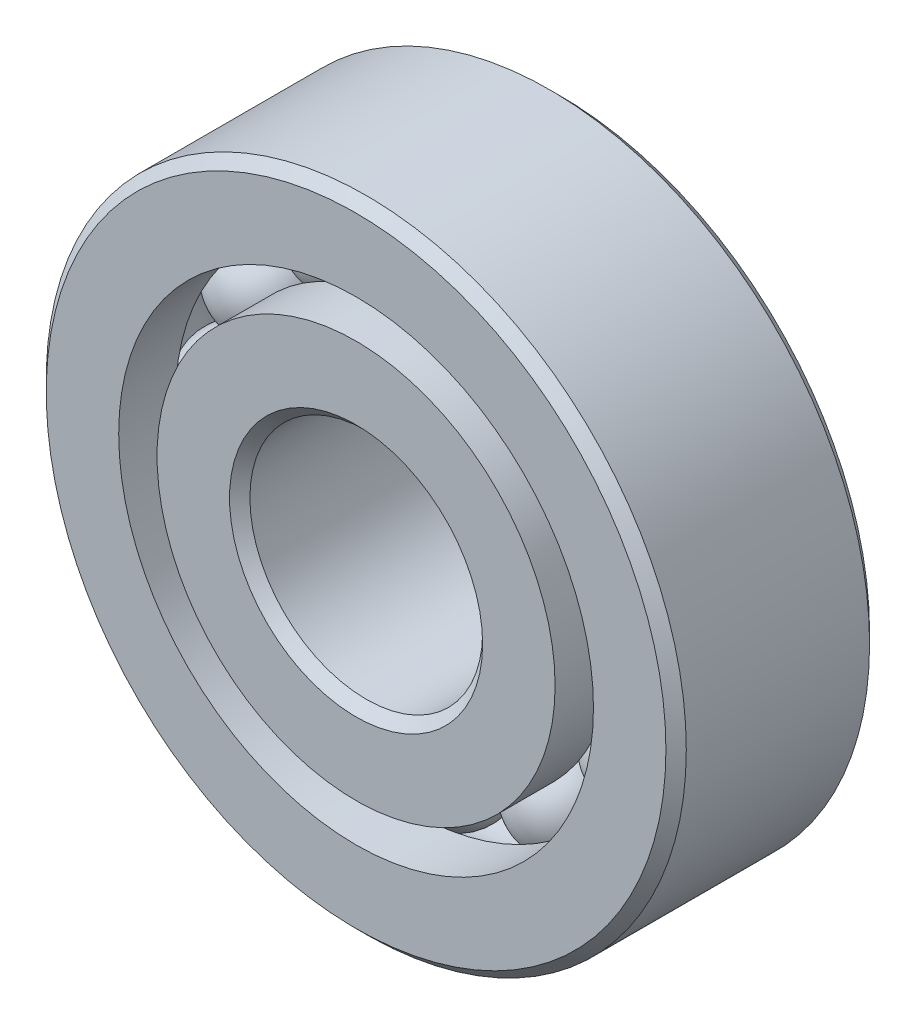
ISO-10303-21;
HEADER;
FILE_DESCRIPTION(('STEP AP214'),'2;1');
FILE_NAME('part.step','',(''),(''),'','','');
FILE_SCHEMA(('AUTOMOTIVE_DESIGN { 1 0 10303 214 1 1 1 1 }'));
ENDSEC;
DATA;
#1=APPLICATION_CONTEXT('core data for automotive mechanical design processes');
#2=APPLICATION_PROTOCOL_DEFINITION('international standard','automotive_design',2000,#1);
#3=PRODUCT_CONTEXT('',#1,'mechanical');
#4=PRODUCT('Part','Part','',(#3));
#5=PRODUCT_RELATED_PRODUCT_CATEGORY('part','',(#4));
#6=PRODUCT_DEFINITION_FORMATION('','',#4);
#7=PRODUCT_DEFINITION_CONTEXT('part definition',#1,'design');
#8=PRODUCT_DEFINITION('design','',#6,#7);
#9=PRODUCT_DEFINITION_SHAPE('','',#8);
#10=(LENGTH_UNIT() NAMED_UNIT(*) SI_UNIT(.MILLI.,.METRE.));
#11=(NAMED_UNIT(*) PLANE_ANGLE_UNIT() SI_UNIT($,.RADIAN.));
#12=(NAMED_UNIT(*) SI_UNIT($,.STERADIAN.) SOLID_ANGLE_UNIT());
#13=UNCERTAINTY_MEASURE_WITH_UNIT(LENGTH_MEASURE(1.E-05),#10,'distance_accuracy_value','');
#14=(GEOMETRIC_REPRESENTATION_CONTEXT(3) GLOBAL_UNCERTAINTY_ASSIGNED_CONTEXT((#13)) GLOBAL_UNIT_ASSIGNED_CONTEXT((#10,
#11,#12)) REPRESENTATION_CONTEXT('',''));
#15=CARTESIAN_POINT('',(0.,0.,0.));
#16=DIRECTION('',(0.,0.,1.));
#17=DIRECTION('',(1.,0.,0.));
#18=AXIS2_PLACEMENT_3D('',#15,#16,#17);
#19=CARTESIAN_POINT('',(-3.74999999999992,6.49519052838334,0.));
#20=DIRECTION('',(0.,0.,1.));
#21=DIRECTION('',(-0.499999999999989,0.866025403784445,0.));
#22=AXIS2_PLACEMENT_3D('',#19,#20,#21);
#23=SPHERICAL_SURFACE('',#22,1.68952158656808);
#24=CARTESIAN_POINT('',(-3.74999999999992,6.49519052838334,1.68952158656808));
#25=VERTEX_POINT('',#24);
#26=VERTEX_LOOP('',#25);
#27=FACE_BOUND('',#26,.T.);
#28=ADVANCED_FACE('F43',(#27),#23,.T.);
#29=CLOSED_SHELL('',(#28));
#30=MANIFOLD_SOLID_BREP('B2_NOT_SHOWN',#29);
#31=CARTESIAN_POINT('',(-6.49519052838325,3.75000000000008,0.));
#32=DIRECTION('',(0.,0.,1.));
#33=DIRECTION('',(-0.866025403784433,0.50000000000001,0.));
#34=AXIS2_PLACEMENT_3D('',#31,#32,#33);
#35=SPHERICAL_SURFACE('',#34,1.68952158656808);
#36=CARTESIAN_POINT('',(-6.49519052838325,3.75000000000008,1.68952158656808));
#37=VERTEX_POINT('',#36);
#38=VERTEX_LOOP('',#37);
#39=FACE_BOUND('',#38,.T.);
#40=ADVANCED_FACE('F64',(#39),#35,.T.);
#41=CLOSED_SHELL('',(#40));
#42=MANIFOLD_SOLID_BREP('B6_NOT_SHOWN',#41);
#43=CARTESIAN_POINT('',(-7.5,0.,0.));
#44=DIRECTION('',(0.,0.,1.));
#45=DIRECTION('',(-1.,0.,0.));
#46=AXIS2_PLACEMENT_3D('',#43,#44,#45);
#47=SPHERICAL_SURFACE('',#46,1.68952158656808);
#48=CARTESIAN_POINT('',(-7.5,0.,1.68952158656808));
#49=VERTEX_POINT('',#48);
#50=VERTEX_LOOP('',#49);
#51=FACE_BOUND('',#50,.T.);
#52=ADVANCED_FACE('F85',(#51),#47,.T.);
#53=CLOSED_SHELL('',(#52));
#54=MANIFOLD_SOLID_BREP('B39_NOT_SHOWN',#53);
#55=CARTESIAN_POINT('',(-6.49519052838332,-3.74999999999994,0.));
#56=DIRECTION('',(0.,0.,1.));
#57=DIRECTION('',(-0.866025403784443,-0.499999999999992,0.));
#58=AXIS2_PLACEMENT_3D('',#55,#56,#57);
#59=SPHERICAL_SURFACE('',#58,1.68952158656808);
#60=CARTESIAN_POINT('',(-6.49519052838332,-3.74999999999994,1.68952158656808));
#61=VERTEX_POINT('',#60);
#62=VERTEX_LOOP('',#61);
#63=FACE_BOUND('',#62,.T.);
#64=ADVANCED_FACE('F106',(#63),#59,.T.);
#65=CLOSED_SHELL('',(#64));
#66=MANIFOLD_SOLID_BREP('B60_NOT_SHOWN',#65);
#67=CARTESIAN_POINT('',(-3.75000000000005,-6.49519052838326,0.));
#68=DIRECTION('',(0.,0.,1.));
#69=DIRECTION('',(-0.500000000000007,-0.866025403784435,0.));
#70=AXIS2_PLACEMENT_3D('',#67,#68,#69);
#71=SPHERICAL_SURFACE('',#70,1.68952158656808);
#72=CARTESIAN_POINT('',(-3.75000000000005,-6.49519052838326,1.68952158656808));
#73=VERTEX_POINT('',#72);
#74=VERTEX_LOOP('',#73);
#75=FACE_BOUND('',#74,.T.);
#76=ADVANCED_FACE('F127',(#75),#71,.T.);
#77=CLOSED_SHELL('',(#76));
#78=MANIFOLD_SOLID_BREP('B81_NOT_SHOWN',#77);
#79=CARTESIAN_POINT('',(0.,-7.5,0.));
#80=DIRECTION('',(0.,0.,1.));
#81=DIRECTION('',(0.,-1.,0.));
#82=AXIS2_PLACEMENT_3D('',#79,#80,#81);
#83=SPHERICAL_SURFACE('',#82,1.68952158656808);
#84=CARTESIAN_POINT('',(0.,-7.5,1.68952158656808));
#85=VERTEX_POINT('',#84);
#86=VERTEX_LOOP('',#85);
#87=FACE_BOUND('',#86,.T.);
#88=ADVANCED_FACE('F148',(#87),#83,.T.);
#89=CLOSED_SHELL('',(#88));
#90=MANIFOLD_SOLID_BREP('B102_NOT_SHOWN',#89);
#91=CARTESIAN_POINT('',(3.74999999999996,-6.49519052838331,0.));
#92=DIRECTION('',(0.,0.,1.));
#93=DIRECTION('',(0.499999999999995,-0.866025403784442,0.));
#94=AXIS2_PLACEMENT_3D('',#91,#92,#93);
#95=SPHERICAL_SURFACE('',#94,1.68952158656808);
#96=CARTESIAN_POINT('',(3.74999999999996,-6.49519052838331,1.68952158656808));
#97=VERTEX_POINT('',#96);
#98=VERTEX_LOOP('',#97);
#99=FACE_BOUND('',#98,.T.);
#100=ADVANCED_FACE('F169',(#99),#95,.T.);
#101=CLOSED_SHELL('',(#100));
#102=MANIFOLD_SOLID_BREP('B123_NOT_SHOWN',#101);
#103=CARTESIAN_POINT('',(6.49519052838327,-3.75000000000003,0.));
#104=DIRECTION('',(0.,0.,1.));
#105=DIRECTION('',(0.866025403784436,-0.500000000000004,0.));
#106=AXIS2_PLACEMENT_3D('',#103,#104,#105);
#107=SPHERICAL_SURFACE('',#106,1.68952158656808);
#108=CARTESIAN_POINT('',(6.49519052838327,-3.75000000000003,1.68952158656808));
#109=VERTEX_POINT('',#108);
#110=VERTEX_LOOP('',#109);
#111=FACE_BOUND('',#110,.T.);
#112=ADVANCED_FACE('F190',(#111),#107,.T.);
#113=CLOSED_SHELL('',(#112));
#114=MANIFOLD_SOLID_BREP('B144_NOT_SHOWN',#113);
#115=CARTESIAN_POINT('',(7.5,0.,0.));
#116=DIRECTION('',(0.,0.,1.));
#117=DIRECTION('',(1.,0.,0.));
#118=AXIS2_PLACEMENT_3D('',#115,#116,#117);
#119=SPHERICAL_SURFACE('',#118,1.68952158656808);
#120=CARTESIAN_POINT('',(7.5,0.,1.68952158656808));
#121=VERTEX_POINT('',#120);
#122=VERTEX_LOOP('',#121);
#123=FACE_BOUND('',#122,.T.);
#124=ADVANCED_FACE('F211',(#123),#119,.T.);
#125=CLOSED_SHELL('',(#124));
#126=MANIFOLD_SOLID_BREP('B165_NOT_SHOWN',#125);
#127=CARTESIAN_POINT('',(6.4951905283833,3.74999999999998,0.));
#128=DIRECTION('',(0.,0.,1.));
#129=DIRECTION('',(0.86602540378444,0.499999999999998,0.));
#130=AXIS2_PLACEMENT_3D('',#127,#128,#129);
#131=SPHERICAL_SURFACE('',#130,1.68952158656808);
#132=CARTESIAN_POINT('',(6.4951905283833,3.74999999999998,1.68952158656808));
#133=VERTEX_POINT('',#132);
#134=VERTEX_LOOP('',#133);
#135=FACE_BOUND('',#134,.T.);
#136=ADVANCED_FACE('F232',(#135),#131,.T.);
#137=CLOSED_SHELL('',(#136));
#138=MANIFOLD_SOLID_BREP('B186_NOT_SHOWN',#137);
#139=CARTESIAN_POINT('',(3.75000000000001,6.49519052838328,0.));
#140=DIRECTION('',(0.,0.,1.));
#141=DIRECTION('',(0.500000000000001,0.866025403784438,0.));
#142=AXIS2_PLACEMENT_3D('',#139,#140,#141);
#143=SPHERICAL_SURFACE('',#142,1.68952158656808);
#144=CARTESIAN_POINT('',(3.75000000000001,6.49519052838328,1.68952158656808));
#145=VERTEX_POINT('',#144);
#146=VERTEX_LOOP('',#145);
#147=FACE_BOUND('',#146,.T.);
#148=ADVANCED_FACE('F253',(#147),#143,.T.);
#149=CLOSED_SHELL('',(#148));
#150=MANIFOLD_SOLID_BREP('B207_NOT_SHOWN',#149);
#151=CARTESIAN_POINT('',(0.,7.5,0.));
#152=DIRECTION('',(0.,0.,1.));
#153=DIRECTION('',(0.,1.,0.));
#154=AXIS2_PLACEMENT_3D('',#151,#152,#153);
#155=SPHERICAL_SURFACE('',#154,1.68952158656808);
#156=CARTESIAN_POINT('',(0.,7.5,1.68952158656808));
#157=VERTEX_POINT('',#156);
#158=VERTEX_LOOP('',#157);
#159=FACE_BOUND('',#158,.T.);
#160=ADVANCED_FACE('F275',(#159),#155,.T.);
#161=CLOSED_SHELL('',(#160));
#162=MANIFOLD_SOLID_BREP('B228',#161);
#163=CARTESIAN_POINT('',(0.,6.84065934065934,3.5));
#164=DIRECTION('',(0.,0.,-1.));
#165=DIRECTION('',(-1.,0.,0.));
#166=AXIS2_PLACEMENT_3D('',#163,#164,#165);
#167=PLANE('',#166);
#168=CARTESIAN_POINT('',(0.,0.,3.5));
#169=DIRECTION('',(0.,0.,1.));
#170=DIRECTION('',(1.,0.,0.));
#171=AXIS2_PLACEMENT_3D('',#168,#169,#170);
#172=CIRCLE('',#171,4.35);
#173=CARTESIAN_POINT('',(4.35,0.,3.5));
#174=VERTEX_POINT('',#173);
#175=EDGE_CURVE('E323',#174,#174,#172,.T.);
#176=ORIENTED_EDGE('',*,*,#175,.F.);
#177=EDGE_LOOP('',(#176));
#178=FACE_BOUND('',#177,.T.);
#179=CARTESIAN_POINT('',(0.,0.,3.5));
#180=DIRECTION('',(0.,0.,1.));
#181=DIRECTION('',(1.,0.,0.));
#182=AXIS2_PLACEMENT_3D('',#179,#180,#181);
#183=CIRCLE('',#182,6.84065934065934);
#184=CARTESIAN_POINT('',(6.84065934065934,0.,3.5));
#185=VERTEX_POINT('',#184);
#186=EDGE_CURVE('E274',#185,#185,#183,.T.);
#187=ORIENTED_EDGE('',*,*,#186,.T.);
#188=EDGE_LOOP('',(#187));
#189=FACE_BOUND('',#188,.T.);
#190=ADVANCED_FACE('F295',(#178,#189),#167,.F.);
#191=CARTESIAN_POINT('',(0.,0.,3.5));
#192=DIRECTION('',(0.,0.,1.));
#193=DIRECTION('',(1.,0.,0.));
#194=AXIS2_PLACEMENT_3D('',#191,#192,#193);
#195=CYLINDRICAL_SURFACE('',#194,6.84065934065934);
#196=ORIENTED_EDGE('',*,*,#186,.F.);
#197=EDGE_LOOP('',(#196));
#198=FACE_BOUND('',#197,.T.);
#199=CARTESIAN_POINT('',(0.,0.,1.55555555555556));
#200=DIRECTION('',(0.,0.,1.));
#201=DIRECTION('',(1.,0.,0.));
#202=AXIS2_PLACEMENT_3D('',#199,#200,#201);
#203=CIRCLE('',#202,6.84065934065934);
#204=CARTESIAN_POINT('',(6.84065934065934,0.,1.55555555555556));
#205=VERTEX_POINT('',#204);
#206=EDGE_CURVE('E301',#205,#205,#203,.T.);
#207=ORIENTED_EDGE('',*,*,#206,.T.);
#208=EDGE_LOOP('',(#207));
#209=FACE_BOUND('',#208,.T.);
#210=ADVANCED_FACE('F330',(#198,#209),#195,.T.);
#211=CARTESIAN_POINT('',(0.,0.,0.));
#212=DIRECTION('',(0.,0.,1.));
#213=DIRECTION('',(1.,0.,0.));
#214=AXIS2_PLACEMENT_3D('',#211,#212,#213);
#215=TOROIDAL_SURFACE('',#214,7.5,1.68952158656808);
#216=ORIENTED_EDGE('',*,*,#206,.F.);
#217=EDGE_LOOP('',(#216));
#218=FACE_BOUND('',#217,.T.);
#219=CARTESIAN_POINT('',(0.,0.,-1.55555555555556));
#220=DIRECTION('',(0.,0.,1.));
#221=DIRECTION('',(1.,0.,0.));
#222=AXIS2_PLACEMENT_3D('',#219,#220,#221);
#223=CIRCLE('',#222,6.84065934065934);
#224=CARTESIAN_POINT('',(6.84065934065934,0.,-1.55555555555556));
#225=VERTEX_POINT('',#224);
#226=EDGE_CURVE('E305',#225,#225,#223,.T.);
#227=ORIENTED_EDGE('',*,*,#226,.T.);
#228=EDGE_LOOP('',(#227));
#229=FACE_BOUND('',#228,.T.);
#230=ADVANCED_FACE('F334',(#218,#229),#215,.F.);
#231=CARTESIAN_POINT('',(0.,0.,3.5));
#232=DIRECTION('',(0.,0.,1.));
#233=DIRECTION('',(1.,0.,0.));
#234=AXIS2_PLACEMENT_3D('',#231,#232,#233);
#235=CYLINDRICAL_SURFACE('',#234,6.84065934065934);
#236=ORIENTED_EDGE('',*,*,#226,.F.);
#237=EDGE_LOOP('',(#236));
#238=FACE_BOUND('',#237,.T.);
#239=CARTESIAN_POINT('',(0.,0.,-3.5));
#240=DIRECTION('',(0.,0.,1.));
#241=DIRECTION('',(1.,0.,0.));
#242=AXIS2_PLACEMENT_3D('',#239,#240,#241);
#243=CIRCLE('',#242,6.84065934065934);
#244=CARTESIAN_POINT('',(6.84065934065934,0.,-3.5));
#245=VERTEX_POINT('',#244);
#246=EDGE_CURVE('E309',#245,#245,#243,.T.);
#247=ORIENTED_EDGE('',*,*,#246,.T.);
#248=EDGE_LOOP('',(#247));
#249=FACE_BOUND('',#248,.T.);
#250=ADVANCED_FACE('F339',(#238,#249),#235,.T.);
#251=CARTESIAN_POINT('',(0.,4.35,-3.5));
#252=DIRECTION('',(0.,0.,1.));
#253=DIRECTION('',(1.,0.,0.));
#254=AXIS2_PLACEMENT_3D('',#251,#252,#253);
#255=PLANE('',#254);
#256=ORIENTED_EDGE('',*,*,#246,.F.);
#257=EDGE_LOOP('',(#256));
#258=FACE_BOUND('',#257,.T.);
#259=CARTESIAN_POINT('',(0.,0.,-3.5));
#260=DIRECTION('',(0.,0.,1.));
#261=DIRECTION('',(1.,0.,0.));
#262=AXIS2_PLACEMENT_3D('',#259,#260,#261);
#263=CIRCLE('',#262,4.35);
#264=CARTESIAN_POINT('',(4.35,0.,-3.5));
#265=VERTEX_POINT('',#264);
#266=EDGE_CURVE('E314',#265,#265,#263,.T.);
#267=ORIENTED_EDGE('',*,*,#266,.T.);
#268=EDGE_LOOP('',(#267));
#269=FACE_BOUND('',#268,.T.);
#270=ADVANCED_FACE('F345',(#258,#269),#255,.F.);
#271=CARTESIAN_POINT('',(0.,0.,-3.15));
#272=DIRECTION('',(0.,0.,-1.));
#273=DIRECTION('',(-1.,0.,0.));
#274=AXIS2_PLACEMENT_3D('',#271,#272,#273);
#275=CONICAL_SURFACE('',#274,4.,0.785398163397446);
#276=ORIENTED_EDGE('',*,*,#266,.F.);
#277=EDGE_LOOP('',(#276));
#278=FACE_BOUND('',#277,.T.);
#279=CARTESIAN_POINT('',(0.,0.,-3.15));
#280=DIRECTION('',(0.,0.,1.));
#281=DIRECTION('',(1.,0.,0.));
#282=AXIS2_PLACEMENT_3D('',#279,#280,#281);
#283=CIRCLE('',#282,4.);
#284=CARTESIAN_POINT('',(4.,0.,-3.15));
#285=VERTEX_POINT('',#284);
#286=EDGE_CURVE('E317',#285,#285,#283,.T.);
#287=ORIENTED_EDGE('',*,*,#286,.T.);
#288=EDGE_LOOP('',(#287));
#289=FACE_BOUND('',#288,.T.);
#290=ADVANCED_FACE('F349',(#278,#289),#275,.F.);
#291=CARTESIAN_POINT('',(0.,0.,3.5));
#292=DIRECTION('',(0.,0.,1.));
#293=DIRECTION('',(1.,0.,0.));
#294=AXIS2_PLACEMENT_3D('',#291,#292,#293);
#295=CYLINDRICAL_SURFACE('',#294,4.);
#296=ORIENTED_EDGE('',*,*,#286,.F.);
#297=EDGE_LOOP('',(#296));
#298=FACE_BOUND('',#297,.T.);
#299=CARTESIAN_POINT('',(0.,0.,3.15));
#300=DIRECTION('',(0.,0.,1.));
#301=DIRECTION('',(1.,0.,0.));
#302=AXIS2_PLACEMENT_3D('',#299,#300,#301);
#303=CIRCLE('',#302,4.);
#304=CARTESIAN_POINT('',(4.,0.,3.15));
#305=VERTEX_POINT('',#304);
#306=EDGE_CURVE('E320',#305,#305,#303,.T.);
#307=ORIENTED_EDGE('',*,*,#306,.T.);
#308=EDGE_LOOP('',(#307));
#309=FACE_BOUND('',#308,.T.);
#310=ADVANCED_FACE('F353',(#298,#309),#295,.F.);
#311=CARTESIAN_POINT('',(0.,0.,3.5));
#312=DIRECTION('',(0.,0.,1.));
#313=DIRECTION('',(1.,0.,0.));
#314=AXIS2_PLACEMENT_3D('',#311,#312,#313);
#315=CONICAL_SURFACE('',#314,4.35,0.785398163397449);
#316=ORIENTED_EDGE('',*,*,#306,.F.);
#317=EDGE_LOOP('',(#316));
#318=FACE_BOUND('',#317,.T.);
#319=ORIENTED_EDGE('',*,*,#175,.T.);
#320=EDGE_LOOP('',(#319));
#321=FACE_BOUND('',#320,.T.);
#322=ADVANCED_FACE('F327',(#318,#321),#315,.F.);
#323=CLOSED_SHELL('',(#190,#210,#230,#250,#270,#290,#310,#322));
#324=MANIFOLD_SOLID_BREP('B249',#323);
#325=CARTESIAN_POINT('',(0.,0.,3.15));
#326=DIRECTION('',(0.,0.,-1.));
#327=DIRECTION('',(-1.,0.,0.));
#328=AXIS2_PLACEMENT_3D('',#325,#326,#327);
#329=CONICAL_SURFACE('',#328,11.,0.785398163397448);
#330=CARTESIAN_POINT('',(0.,0.,3.5));
#331=DIRECTION('',(0.,0.,1.));
#332=DIRECTION('',(1.,0.,0.));
#333=AXIS2_PLACEMENT_3D('',#330,#331,#332);
#334=CIRCLE('',#333,10.65);
#335=CARTESIAN_POINT('',(10.65,0.,3.5));
#336=VERTEX_POINT('',#335);
#337=EDGE_CURVE('E445',#336,#336,#334,.T.);
#338=ORIENTED_EDGE('',*,*,#337,.F.);
#339=EDGE_LOOP('',(#338));
#340=FACE_BOUND('',#339,.T.);
#341=CARTESIAN_POINT('',(0.,0.,3.15));
#342=DIRECTION('',(0.,0.,1.));
#343=DIRECTION('',(1.,0.,0.));
#344=AXIS2_PLACEMENT_3D('',#341,#342,#343);
#345=CIRCLE('',#344,11.);
#346=CARTESIAN_POINT('',(11.,0.,3.15));
#347=VERTEX_POINT('',#346);
#348=EDGE_CURVE('E294',#347,#347,#345,.T.);
#349=ORIENTED_EDGE('',*,*,#348,.T.);
#350=EDGE_LOOP('',(#349));
#351=FACE_BOUND('',#350,.T.);
#352=ADVANCED_FACE('F417',(#340,#351),#329,.T.);
#353=CARTESIAN_POINT('',(0.,0.,3.5));
#354=DIRECTION('',(0.,0.,1.));
#355=DIRECTION('',(1.,0.,0.));
#356=AXIS2_PLACEMENT_3D('',#353,#354,#355);
#357=CYLINDRICAL_SURFACE('',#356,11.);
#358=ORIENTED_EDGE('',*,*,#348,.F.);
#359=EDGE_LOOP('',(#358));
#360=FACE_BOUND('',#359,.T.);
#361=CARTESIAN_POINT('',(0.,0.,-3.15));
#362=DIRECTION('',(0.,0.,1.));
#363=DIRECTION('',(1.,0.,0.));
#364=AXIS2_PLACEMENT_3D('',#361,#362,#363);
#365=CIRCLE('',#364,11.);
#366=CARTESIAN_POINT('',(11.,0.,-3.15));
#367=VERTEX_POINT('',#366);
#368=EDGE_CURVE('E423',#367,#367,#365,.T.);
#369=ORIENTED_EDGE('',*,*,#368,.T.);
#370=EDGE_LOOP('',(#369));
#371=FACE_BOUND('',#370,.T.);
#372=ADVANCED_FACE('F452',(#360,#371),#357,.T.);
#373=CARTESIAN_POINT('',(0.,0.,-3.5));
#374=DIRECTION('',(0.,0.,1.));
#375=DIRECTION('',(1.,0.,0.));
#376=AXIS2_PLACEMENT_3D('',#373,#374,#375);
#377=CONICAL_SURFACE('',#376,10.65,0.785398163397447);
#378=ORIENTED_EDGE('',*,*,#368,.F.);
#379=EDGE_LOOP('',(#378));
#380=FACE_BOUND('',#379,.T.);
#381=CARTESIAN_POINT('',(0.,0.,-3.5));
#382=DIRECTION('',(0.,0.,1.));
#383=DIRECTION('',(1.,0.,0.));
#384=AXIS2_PLACEMENT_3D('',#381,#382,#383);
#385=CIRCLE('',#384,10.65);
#386=CARTESIAN_POINT('',(10.65,0.,-3.5));
#387=VERTEX_POINT('',#386);
#388=EDGE_CURVE('E427',#387,#387,#385,.T.);
#389=ORIENTED_EDGE('',*,*,#388,.T.);
#390=EDGE_LOOP('',(#389));
#391=FACE_BOUND('',#390,.T.);
#392=ADVANCED_FACE('F456',(#380,#391),#377,.T.);
#393=CARTESIAN_POINT('',(0.,10.65,-3.5));
#394=DIRECTION('',(0.,0.,1.));
#395=DIRECTION('',(1.,0.,0.));
#396=AXIS2_PLACEMENT_3D('',#393,#394,#395);
#397=PLANE('',#396);
#398=ORIENTED_EDGE('',*,*,#388,.F.);
#399=EDGE_LOOP('',(#398));
#400=FACE_BOUND('',#399,.T.);
#401=CARTESIAN_POINT('',(0.,0.,-3.5));
#402=DIRECTION('',(0.,0.,1.));
#403=DIRECTION('',(1.,0.,0.));
#404=AXIS2_PLACEMENT_3D('',#401,#402,#403);
#405=CIRCLE('',#404,8.15934065934066);
#406=CARTESIAN_POINT('',(8.15934065934066,0.,-3.5));
#407=VERTEX_POINT('',#406);
#408=EDGE_CURVE('E431',#407,#407,#405,.T.);
#409=ORIENTED_EDGE('',*,*,#408,.T.);
#410=EDGE_LOOP('',(#409));
#411=FACE_BOUND('',#410,.T.);
#412=ADVANCED_FACE('F461',(#400,#411),#397,.F.);
#413=CARTESIAN_POINT('',(0.,0.,3.5));
#414=DIRECTION('',(0.,0.,1.));
#415=DIRECTION('',(1.,0.,0.));
#416=AXIS2_PLACEMENT_3D('',#413,#414,#415);
#417=CYLINDRICAL_SURFACE('',#416,8.15934065934066);
#418=ORIENTED_EDGE('',*,*,#408,.F.);
#419=EDGE_LOOP('',(#418));
#420=FACE_BOUND('',#419,.T.);
#421=CARTESIAN_POINT('',(0.,0.,-1.55555555555556));
#422=DIRECTION('',(0.,0.,1.));
#423=DIRECTION('',(1.,0.,0.));
#424=AXIS2_PLACEMENT_3D('',#421,#422,#423);
#425=CIRCLE('',#424,8.15934065934066);
#426=CARTESIAN_POINT('',(8.15934065934066,0.,-1.55555555555556));
#427=VERTEX_POINT('',#426);
#428=EDGE_CURVE('E436',#427,#427,#425,.T.);
#429=ORIENTED_EDGE('',*,*,#428,.T.);
#430=EDGE_LOOP('',(#429));
#431=FACE_BOUND('',#430,.T.);
#432=ADVANCED_FACE('F467',(#420,#431),#417,.F.);
#433=CARTESIAN_POINT('',(0.,0.,0.));
#434=DIRECTION('',(0.,0.,1.));
#435=DIRECTION('',(1.,0.,0.));
#436=AXIS2_PLACEMENT_3D('',#433,#434,#435);
#437=TOROIDAL_SURFACE('',#436,7.5,1.68952158656808);
#438=ORIENTED_EDGE('',*,*,#428,.F.);
#439=EDGE_LOOP('',(#438));
#440=FACE_BOUND('',#439,.T.);
#441=CARTESIAN_POINT('',(0.,0.,1.55555555555555));
#442=DIRECTION('',(0.,0.,1.));
#443=DIRECTION('',(1.,0.,0.));
#444=AXIS2_PLACEMENT_3D('',#441,#442,#443);
#445=CIRCLE('',#444,8.15934065934066);
#446=CARTESIAN_POINT('',(8.15934065934066,0.,1.55555555555555));
#447=VERTEX_POINT('',#446);
#448=EDGE_CURVE('E439',#447,#447,#445,.T.);
#449=ORIENTED_EDGE('',*,*,#448,.T.);
#450=EDGE_LOOP('',(#449));
#451=FACE_BOUND('',#450,.T.);
#452=ADVANCED_FACE('F471',(#440,#451),#437,.F.);
#453=CARTESIAN_POINT('',(0.,0.,3.5));
#454=DIRECTION('',(0.,0.,1.));
#455=DIRECTION('',(1.,0.,0.));
#456=AXIS2_PLACEMENT_3D('',#453,#454,#455);
#457=CYLINDRICAL_SURFACE('',#456,8.15934065934066);
#458=ORIENTED_EDGE('',*,*,#448,.F.);
#459=EDGE_LOOP('',(#458));
#460=FACE_BOUND('',#459,.T.);
#461=CARTESIAN_POINT('',(0.,0.,3.5));
#462=DIRECTION('',(0.,0.,1.));
#463=DIRECTION('',(1.,0.,0.));
#464=AXIS2_PLACEMENT_3D('',#461,#462,#463);
#465=CIRCLE('',#464,8.15934065934066);
#466=CARTESIAN_POINT('',(8.15934065934066,0.,3.5));
#467=VERTEX_POINT('',#466);
#468=EDGE_CURVE('E442',#467,#467,#465,.T.);
#469=ORIENTED_EDGE('',*,*,#468,.T.);
#470=EDGE_LOOP('',(#469));
#471=FACE_BOUND('',#470,.T.);
#472=ADVANCED_FACE('F475',(#460,#471),#457,.F.);
#473=CARTESIAN_POINT('',(0.,10.65,3.5));
#474=DIRECTION('',(0.,0.,-1.));
#475=DIRECTION('',(-1.,0.,0.));
#476=AXIS2_PLACEMENT_3D('',#473,#474,#475);
#477=PLANE('',#476);
#478=ORIENTED_EDGE('',*,*,#468,.F.);
#479=EDGE_LOOP('',(#478));
#480=FACE_BOUND('',#479,.T.);
#481=ORIENTED_EDGE('',*,*,#337,.T.);
#482=EDGE_LOOP('',(#481));
#483=FACE_BOUND('',#482,.T.);
#484=ADVANCED_FACE('F449',(#480,#483),#477,.F.);
#485=CLOSED_SHELL('',(#352,#372,#392,#412,#432,#452,#472,#484));
#486=MANIFOLD_SOLID_BREP('B269',#485);
#487=ADVANCED_BREP_SHAPE_REPRESENTATION('',(#18,#30,#42,#54,#66,#78,#90,#102,#114,#126,#138,
#150,#162,#324,#486),#14);
#488=SHAPE_DEFINITION_REPRESENTATION(#9,#487);
ENDSEC;
END-ISO-10303-21;
